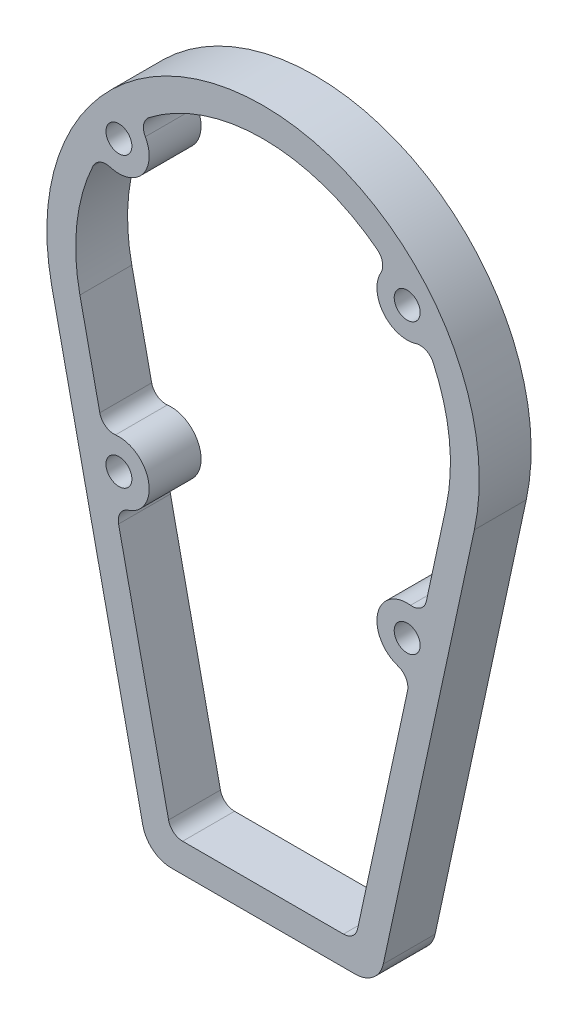
ISO-10303-21;
HEADER;
FILE_DESCRIPTION(('STEP AP214'),'2;1');
FILE_NAME('part.step','',(''),(''),'','','');
FILE_SCHEMA(('AUTOMOTIVE_DESIGN { 1 0 10303 214 1 1 1 1 }'));
ENDSEC;
DATA;
#1=APPLICATION_CONTEXT('core data for automotive mechanical design processes');
#2=APPLICATION_PROTOCOL_DEFINITION('international standard','automotive_design',2000,#1);
#3=PRODUCT_CONTEXT('',#1,'mechanical');
#4=PRODUCT('Part','Part','',(#3));
#5=PRODUCT_RELATED_PRODUCT_CATEGORY('part','',(#4));
#6=PRODUCT_DEFINITION_FORMATION('','',#4);
#7=PRODUCT_DEFINITION_CONTEXT('part definition',#1,'design');
#8=PRODUCT_DEFINITION('design','',#6,#7);
#9=PRODUCT_DEFINITION_SHAPE('','',#8);
#10=(LENGTH_UNIT() NAMED_UNIT(*) SI_UNIT(.MILLI.,.METRE.));
#11=(NAMED_UNIT(*) PLANE_ANGLE_UNIT() SI_UNIT($,.RADIAN.));
#12=(NAMED_UNIT(*) SI_UNIT($,.STERADIAN.) SOLID_ANGLE_UNIT());
#13=UNCERTAINTY_MEASURE_WITH_UNIT(LENGTH_MEASURE(1.E-05),#10,'distance_accuracy_value','');
#14=(GEOMETRIC_REPRESENTATION_CONTEXT(3) GLOBAL_UNCERTAINTY_ASSIGNED_CONTEXT((#13)) GLOBAL_UNIT_ASSIGNED_CONTEXT((#10,
#11,#12)) REPRESENTATION_CONTEXT('',''));
#15=CARTESIAN_POINT('',(0.,0.,0.));
#16=DIRECTION('',(0.,0.,1.));
#17=DIRECTION('',(1.,0.,0.));
#18=AXIS2_PLACEMENT_3D('',#15,#16,#17);
#19=CARTESIAN_POINT('',(-31.9298733487398,-112.5,18.));
#20=DIRECTION('',(0.,0.,1.));
#21=DIRECTION('',(1.,0.,0.));
#22=AXIS2_PLACEMENT_3D('',#19,#20,#21);
#23=PLANE('',#22);
#24=CARTESIAN_POINT('',(-50.,87.5,18.));
#25=DIRECTION('',(0.,0.,1.));
#26=DIRECTION('',(1.,0.,0.));
#27=AXIS2_PLACEMENT_3D('',#24,#25,#26);
#28=CIRCLE('',#27,4.5);
#29=CARTESIAN_POINT('',(-45.5,87.5,18.));
#30=VERTEX_POINT('',#29);
#31=EDGE_CURVE('E308',#30,#30,#28,.T.);
#32=ORIENTED_EDGE('',*,*,#31,.F.);
#33=EDGE_LOOP('',(#32));
#34=FACE_BOUND('',#33,.T.);
#35=CARTESIAN_POINT('',(50.,-12.5,18.));
#36=DIRECTION('',(0.,0.,1.));
#37=DIRECTION('',(1.,0.,0.));
#38=AXIS2_PLACEMENT_3D('',#35,#36,#37);
#39=CIRCLE('',#38,4.5);
#40=CARTESIAN_POINT('',(54.5,-12.5,18.));
#41=VERTEX_POINT('',#40);
#42=EDGE_CURVE('E320',#41,#41,#39,.T.);
#43=ORIENTED_EDGE('',*,*,#42,.F.);
#44=EDGE_LOOP('',(#43));
#45=FACE_BOUND('',#44,.T.);
#46=CARTESIAN_POINT('',(-31.9298733487398,-112.5,18.));
#47=DIRECTION('',(0.,0.,1.));
#48=DIRECTION('',(1.,0.,0.));
#49=AXIS2_PLACEMENT_3D('',#46,#47,#48);
#50=CIRCLE('',#49,10.);
#51=CARTESIAN_POINT('',(-41.7043249889033,-114.611893731726,18.));
#52=VERTEX_POINT('',#51);
#53=CARTESIAN_POINT('',(-31.9298733487398,-122.5,18.));
#54=VERTEX_POINT('',#53);
#55=EDGE_CURVE('E326',#52,#54,#50,.T.);
#56=ORIENTED_EDGE('',*,*,#55,.T.);
#57=DIRECTION('',(1.,0.,0.));
#58=VECTOR('',#57,1.);
#59=CARTESIAN_POINT('',(-31.9298733487398,-122.5,18.));
#60=LINE('',#59,#58);
#61=CARTESIAN_POINT('',(31.9298733487398,-122.5,18.));
#62=VERTEX_POINT('',#61);
#63=EDGE_CURVE('E329',#54,#62,#60,.T.);
#64=ORIENTED_EDGE('',*,*,#63,.T.);
#65=CARTESIAN_POINT('',(31.9298733487398,-112.5,18.));
#66=DIRECTION('',(0.,0.,1.));
#67=DIRECTION('',(1.,0.,0.));
#68=AXIS2_PLACEMENT_3D('',#65,#66,#67);
#69=CIRCLE('',#68,10.);
#70=CARTESIAN_POINT('',(41.7043249889033,-114.611893731726,18.));
#71=VERTEX_POINT('',#70);
#72=EDGE_CURVE('E332',#62,#71,#69,.T.);
#73=ORIENTED_EDGE('',*,*,#72,.T.);
#74=DIRECTION('',(0.211189373172623,0.977445164016353,0.));
#75=VECTOR('',#74,1.);
#76=CARTESIAN_POINT('',(41.7043249889033,-114.611893731726,18.));
#77=LINE('',#76,#75);
#78=CARTESIAN_POINT('',(73.3083873012265,31.6607970120533,18.));
#79=VERTEX_POINT('',#78);
#80=EDGE_CURVE('E334',#71,#79,#77,.T.);
#81=ORIENTED_EDGE('',*,*,#80,.T.);
#82=CARTESIAN_POINT('',(0.,47.5,18.));
#83=DIRECTION('',(0.,0.,1.));
#84=DIRECTION('',(1.,0.,0.));
#85=AXIS2_PLACEMENT_3D('',#82,#83,#84);
#86=CIRCLE('',#85,75.);
#87=CARTESIAN_POINT('',(-73.3083873012264,31.6607970120533,18.));
#88=VERTEX_POINT('',#87);
#89=EDGE_CURVE('E336',#79,#88,#86,.T.);
#90=ORIENTED_EDGE('',*,*,#89,.T.);
#91=DIRECTION('',(0.211189373172623,-0.977445164016353,0.));
#92=VECTOR('',#91,1.);
#93=CARTESIAN_POINT('',(-73.3083873012264,31.6607970120533,18.));
#94=LINE('',#93,#92);
#95=EDGE_CURVE('E338',#88,#52,#94,.T.);
#96=ORIENTED_EDGE('',*,*,#95,.T.);
#97=EDGE_LOOP('',(#56,#64,#73,#81,#90,#96));
#98=FACE_BOUND('',#97,.T.);
#99=CARTESIAN_POINT('',(50.,87.5,18.));
#100=DIRECTION('',(0.,0.,1.));
#101=DIRECTION('',(1.,0.,0.));
#102=AXIS2_PLACEMENT_3D('',#99,#100,#101);
#103=CIRCLE('',#102,4.5);
#104=CARTESIAN_POINT('',(54.5,87.5,18.));
#105=VERTEX_POINT('',#104);
#106=EDGE_CURVE('E314',#105,#105,#103,.T.);
#107=ORIENTED_EDGE('',*,*,#106,.F.);
#108=EDGE_LOOP('',(#107));
#109=FACE_BOUND('',#108,.T.);
#110=CARTESIAN_POINT('',(-50.,-12.5,18.));
#111=DIRECTION('',(0.,0.,1.));
#112=DIRECTION('',(1.,0.,0.));
#113=AXIS2_PLACEMENT_3D('',#110,#111,#112);
#114=CIRCLE('',#113,4.5);
#115=CARTESIAN_POINT('',(-45.5,-12.5,18.));
#116=VERTEX_POINT('',#115);
#117=EDGE_CURVE('E302',#116,#116,#114,.T.);
#118=ORIENTED_EDGE('',*,*,#117,.F.);
#119=EDGE_LOOP('',(#118));
#120=FACE_BOUND('',#119,.T.);
#121=DIRECTION('',(0.211189373172623,0.977445164016353,0.));
#122=VECTOR('',#121,1.);
#123=CARTESIAN_POINT('',(55.4723236772757,-3.53876830055554,18.));
#124=LINE('',#123,#122);
#125=CARTESIAN_POINT('',(56.63558344571,1.84513249932773,18.));
#126=VERTEX_POINT('',#125);
#127=CARTESIAN_POINT('',(63.5339356610629,33.7726907437795,18.));
#128=VERTEX_POINT('',#127);
#129=EDGE_CURVE('E215',#126,#128,#124,.T.);
#130=ORIENTED_EDGE('',*,*,#129,.F.);
#131=CARTESIAN_POINT('',(51.7483576256282,2.90107936519085,18.));
#132=DIRECTION('',(0.,0.,1.));
#133=DIRECTION('',(1.,0.,0.));
#134=AXIS2_PLACEMENT_3D('',#131,#132,#133);
#135=CIRCLE('',#134,5.);
#136=CARTESIAN_POINT('',(51.1843712947804,-2.06701075261265,18.));
#137=VERTEX_POINT('',#136);
#138=EDGE_CURVE('E431',#126,#137,#135,.F.);
#139=ORIENTED_EDGE('',*,*,#138,.T.);
#140=CARTESIAN_POINT('',(50.,-12.5,18.));
#141=DIRECTION('',(0.,0.,-1.));
#142=DIRECTION('',(1.,0.,0.));
#143=AXIS2_PLACEMENT_3D('',#140,#141,#142);
#144=CIRCLE('',#143,10.5);
#145=CARTESIAN_POINT('',(46.7714419877795,-22.4913168882648,18.));
#146=VERTEX_POINT('',#145);
#147=EDGE_CURVE('E227',#146,#137,#144,.T.);
#148=ORIENTED_EDGE('',*,*,#147,.F.);
#149=CARTESIAN_POINT('',(45.2340334105316,-27.2490868350576,18.));
#150=DIRECTION('',(0.,0.,1.));
#151=DIRECTION('',(1.,0.,0.));
#152=AXIS2_PLACEMENT_3D('',#149,#150,#151);
#153=CIRCLE('',#152,5.);
#154=CARTESIAN_POINT('',(50.1212592306133,-28.3050337009207,18.));
#155=VERTEX_POINT('',#154);
#156=EDGE_CURVE('E435',#146,#155,#153,.F.);
#157=ORIENTED_EDGE('',*,*,#156,.T.);
#158=DIRECTION('',(0.211189373172623,0.977445164016353,0.));
#159=VECTOR('',#158,1.);
#160=CARTESIAN_POINT('',(31.9298733487398,-112.5,18.));
#161=LINE('',#160,#159);
#162=CARTESIAN_POINT('',(32.7820358431914,-108.555946865863,18.));
#163=VERTEX_POINT('',#162);
#164=EDGE_CURVE('E267',#163,#155,#161,.T.);
#165=ORIENTED_EDGE('',*,*,#164,.F.);
#166=CARTESIAN_POINT('',(27.8948100231097,-107.5,18.));
#167=DIRECTION('',(0.,0.,1.));
#168=DIRECTION('',(1.,0.,0.));
#169=AXIS2_PLACEMENT_3D('',#166,#167,#168);
#170=CIRCLE('',#169,5.);
#171=CARTESIAN_POINT('',(27.8948100231097,-112.5,18.));
#172=VERTEX_POINT('',#171);
#173=EDGE_CURVE('E381',#163,#172,#170,.F.);
#174=ORIENTED_EDGE('',*,*,#173,.T.);
#175=DIRECTION('',(1.,0.,0.));
#176=VECTOR('',#175,1.);
#177=CARTESIAN_POINT('',(-31.9298733487398,-112.5,18.));
#178=LINE('',#177,#176);
#179=CARTESIAN_POINT('',(-27.8948100231097,-112.5,18.));
#180=VERTEX_POINT('',#179);
#181=EDGE_CURVE('E264',#180,#172,#178,.T.);
#182=ORIENTED_EDGE('',*,*,#181,.F.);
#183=CARTESIAN_POINT('',(-27.8948100231097,-107.5,18.));
#184=DIRECTION('',(0.,0.,1.));
#185=DIRECTION('',(1.,0.,0.));
#186=AXIS2_PLACEMENT_3D('',#183,#184,#185);
#187=CIRCLE('',#186,5.);
#188=CARTESIAN_POINT('',(-32.7820358431915,-108.555946865863,18.));
#189=VERTEX_POINT('',#188);
#190=EDGE_CURVE('E385',#180,#189,#187,.F.);
#191=ORIENTED_EDGE('',*,*,#190,.T.);
#192=DIRECTION('',(0.211189373172623,-0.977445164016353,0.));
#193=VECTOR('',#192,1.);
#194=CARTESIAN_POINT('',(-31.9298733487398,-112.5,18.));
#195=LINE('',#194,#193);
#196=CARTESIAN_POINT('',(-50.1212592306133,-28.3050337009208,18.));
#197=VERTEX_POINT('',#196);
#198=EDGE_CURVE('E262',#197,#189,#195,.T.);
#199=ORIENTED_EDGE('',*,*,#198,.F.);
#200=CARTESIAN_POINT('',(-45.2340334105316,-27.2490868350576,18.));
#201=DIRECTION('',(0.,0.,1.));
#202=DIRECTION('',(1.,0.,0.));
#203=AXIS2_PLACEMENT_3D('',#200,#201,#202);
#204=CIRCLE('',#203,5.);
#205=CARTESIAN_POINT('',(-46.7714419877795,-22.4913168882649,18.));
#206=VERTEX_POINT('',#205);
#207=EDGE_CURVE('E439',#197,#206,#204,.F.);
#208=ORIENTED_EDGE('',*,*,#207,.T.);
#209=CARTESIAN_POINT('',(-50.,-12.5,18.));
#210=DIRECTION('',(0.,0.,-1.));
#211=DIRECTION('',(1.,0.,0.));
#212=AXIS2_PLACEMENT_3D('',#209,#210,#211);
#213=CIRCLE('',#212,10.5);
#214=CARTESIAN_POINT('',(-51.1843712947804,-2.06701075261266,18.));
#215=VERTEX_POINT('',#214);
#216=EDGE_CURVE('E259',#215,#206,#213,.T.);
#217=ORIENTED_EDGE('',*,*,#216,.F.);
#218=CARTESIAN_POINT('',(-51.7483576256283,2.90107936519085,18.));
#219=DIRECTION('',(0.,0.,1.));
#220=DIRECTION('',(1.,0.,0.));
#221=AXIS2_PLACEMENT_3D('',#218,#219,#220);
#222=CIRCLE('',#221,5.);
#223=CARTESIAN_POINT('',(-56.63558344571,1.84513249932773,18.));
#224=VERTEX_POINT('',#223);
#225=EDGE_CURVE('E427',#215,#224,#222,.F.);
#226=ORIENTED_EDGE('',*,*,#225,.T.);
#227=DIRECTION('',(0.211189373172623,-0.977445164016353,0.));
#228=VECTOR('',#227,1.);
#229=CARTESIAN_POINT('',(-55.4723236772757,-3.53876830055558,18.));
#230=LINE('',#229,#228);
#231=CARTESIAN_POINT('',(-63.5339356610629,33.7726907437795,18.));
#232=VERTEX_POINT('',#231);
#233=EDGE_CURVE('E256',#232,#224,#230,.T.);
#234=ORIENTED_EDGE('',*,*,#233,.F.);
#235=CARTESIAN_POINT('',(0.,47.5,18.));
#236=DIRECTION('',(0.,0.,1.));
#237=DIRECTION('',(1.,0.,0.));
#238=AXIS2_PLACEMENT_3D('',#235,#236,#237);
#239=CIRCLE('',#238,65.);
#240=CARTESIAN_POINT('',(-59.0097536999229,74.755255791763,18.));
#241=VERTEX_POINT('',#240);
#242=EDGE_CURVE('E254',#241,#232,#239,.T.);
#243=ORIENTED_EDGE('',*,*,#242,.F.);
#244=CARTESIAN_POINT('',(-54.4705418768519,72.6586976539351,18.));
#245=DIRECTION('',(0.,0.,1.));
#246=DIRECTION('',(1.,0.,0.));
#247=AXIS2_PLACEMENT_3D('',#244,#245,#246);
#248=CIRCLE('',#247,5.);
#249=CARTESIAN_POINT('',(-53.0284315939965,77.4462145397625,18.));
#250=VERTEX_POINT('',#249);
#251=EDGE_CURVE('E11',#241,#250,#248,.F.);
#252=ORIENTED_EDGE('',*,*,#251,.T.);
#253=CARTESIAN_POINT('',(-50.,87.5,18.));
#254=DIRECTION('',(0.,0.,-1.));
#255=DIRECTION('',(1.,0.,0.));
#256=AXIS2_PLACEMENT_3D('',#253,#254,#255);
#257=CIRCLE('',#256,10.5);
#258=CARTESIAN_POINT('',(-40.8562064862553,92.661495924439,18.));
#259=VERTEX_POINT('',#258);
#260=EDGE_CURVE('E251',#259,#250,#257,.T.);
#261=ORIENTED_EDGE('',*,*,#260,.F.);
#262=CARTESIAN_POINT('',(-36.5020190987578,95.1193511265528,18.));
#263=DIRECTION('',(0.,0.,1.));
#264=DIRECTION('',(1.,0.,0.));
#265=AXIS2_PLACEMENT_3D('',#262,#263,#264);
#266=CIRCLE('',#265,5.);
#267=CARTESIAN_POINT('',(-39.5438540236543,99.0876303870988,18.));
#268=VERTEX_POINT('',#267);
#269=EDGE_CURVE('E450',#259,#268,#266,.F.);
#270=ORIENTED_EDGE('',*,*,#269,.T.);
#271=CARTESIAN_POINT('',(0.,47.5,18.));
#272=DIRECTION('',(0.,0.,1.));
#273=DIRECTION('',(1.,0.,0.));
#274=AXIS2_PLACEMENT_3D('',#271,#272,#273);
#275=CIRCLE('',#274,65.);
#276=CARTESIAN_POINT('',(39.5438540236543,99.0876303870988,18.));
#277=VERTEX_POINT('',#276);
#278=EDGE_CURVE('E245',#277,#268,#275,.T.);
#279=ORIENTED_EDGE('',*,*,#278,.F.);
#280=CARTESIAN_POINT('',(36.5020190987578,95.1193511265527,18.));
#281=DIRECTION('',(0.,0.,1.));
#282=DIRECTION('',(1.,0.,0.));
#283=AXIS2_PLACEMENT_3D('',#280,#281,#282);
#284=CIRCLE('',#283,5.);
#285=CARTESIAN_POINT('',(40.8562064862553,92.6614959244389,18.));
#286=VERTEX_POINT('',#285);
#287=EDGE_CURVE('E446',#277,#286,#284,.F.);
#288=ORIENTED_EDGE('',*,*,#287,.T.);
#289=CARTESIAN_POINT('',(50.,87.5,18.));
#290=DIRECTION('',(0.,0.,-1.));
#291=DIRECTION('',(1.,0.,0.));
#292=AXIS2_PLACEMENT_3D('',#289,#290,#291);
#293=CIRCLE('',#292,10.5);
#294=CARTESIAN_POINT('',(53.0284315939965,77.4462145397625,18.));
#295=VERTEX_POINT('',#294);
#296=EDGE_CURVE('E242',#295,#286,#293,.T.);
#297=ORIENTED_EDGE('',*,*,#296,.F.);
#298=CARTESIAN_POINT('',(54.470541876852,72.6586976539351,18.));
#299=DIRECTION('',(0.,0.,1.));
#300=DIRECTION('',(1.,0.,0.));
#301=AXIS2_PLACEMENT_3D('',#298,#299,#300);
#302=CIRCLE('',#301,5.);
#303=CARTESIAN_POINT('',(59.009753699923,74.755255791763,18.));
#304=VERTEX_POINT('',#303);
#305=EDGE_CURVE('E241',#295,#304,#302,.F.);
#306=ORIENTED_EDGE('',*,*,#305,.T.);
#307=CARTESIAN_POINT('',(0.,47.5,18.));
#308=DIRECTION('',(0.,0.,1.));
#309=DIRECTION('',(1.,0.,0.));
#310=AXIS2_PLACEMENT_3D('',#307,#308,#309);
#311=CIRCLE('',#310,65.);
#312=EDGE_CURVE('E226',#128,#304,#311,.T.);
#313=ORIENTED_EDGE('',*,*,#312,.F.);
#314=EDGE_LOOP('',(#130,#139,#148,#157,#165,#174,#182,#191,#199,#208,#217,#226,#234,#243,#252,
#261,#270,#279,#288,#297,#306,#313));
#315=FACE_BOUND('',#314,.T.);
#316=ADVANCED_FACE('F32',(#34,#45,#98,#109,#120,#315),#23,.T.);
#317=CARTESIAN_POINT('',(-31.9298733487398,-112.5,0.));
#318=DIRECTION('',(0.,0.,1.));
#319=DIRECTION('',(1.,0.,0.));
#320=AXIS2_PLACEMENT_3D('',#317,#318,#319);
#321=PLANE('',#320);
#322=CARTESIAN_POINT('',(-50.,-12.5,0.));
#323=DIRECTION('',(0.,0.,1.));
#324=DIRECTION('',(1.,0.,0.));
#325=AXIS2_PLACEMENT_3D('',#322,#323,#324);
#326=CIRCLE('',#325,4.5);
#327=CARTESIAN_POINT('',(-45.5,-12.5,0.));
#328=VERTEX_POINT('',#327);
#329=EDGE_CURVE('E236',#328,#328,#326,.T.);
#330=ORIENTED_EDGE('',*,*,#329,.T.);
#331=EDGE_LOOP('',(#330));
#332=FACE_BOUND('',#331,.T.);
#333=CARTESIAN_POINT('',(-50.,87.5,0.));
#334=DIRECTION('',(0.,0.,1.));
#335=DIRECTION('',(1.,0.,0.));
#336=AXIS2_PLACEMENT_3D('',#333,#334,#335);
#337=CIRCLE('',#336,4.5);
#338=CARTESIAN_POINT('',(-45.5,87.5,0.));
#339=VERTEX_POINT('',#338);
#340=EDGE_CURVE('E305',#339,#339,#337,.T.);
#341=ORIENTED_EDGE('',*,*,#340,.T.);
#342=EDGE_LOOP('',(#341));
#343=FACE_BOUND('',#342,.T.);
#344=CARTESIAN_POINT('',(50.,87.5,0.));
#345=DIRECTION('',(0.,0.,1.));
#346=DIRECTION('',(1.,0.,0.));
#347=AXIS2_PLACEMENT_3D('',#344,#345,#346);
#348=CIRCLE('',#347,4.5);
#349=CARTESIAN_POINT('',(54.5,87.5,0.));
#350=VERTEX_POINT('',#349);
#351=EDGE_CURVE('E311',#350,#350,#348,.T.);
#352=ORIENTED_EDGE('',*,*,#351,.T.);
#353=EDGE_LOOP('',(#352));
#354=FACE_BOUND('',#353,.T.);
#355=CARTESIAN_POINT('',(50.,-12.5,0.));
#356=DIRECTION('',(0.,0.,1.));
#357=DIRECTION('',(1.,0.,0.));
#358=AXIS2_PLACEMENT_3D('',#355,#356,#357);
#359=CIRCLE('',#358,4.5);
#360=CARTESIAN_POINT('',(54.5,-12.5,0.));
#361=VERTEX_POINT('',#360);
#362=EDGE_CURVE('E317',#361,#361,#359,.T.);
#363=ORIENTED_EDGE('',*,*,#362,.T.);
#364=EDGE_LOOP('',(#363));
#365=FACE_BOUND('',#364,.T.);
#366=CARTESIAN_POINT('',(-31.9298733487398,-112.5,0.));
#367=DIRECTION('',(0.,0.,1.));
#368=DIRECTION('',(1.,0.,0.));
#369=AXIS2_PLACEMENT_3D('',#366,#367,#368);
#370=CIRCLE('',#369,10.);
#371=CARTESIAN_POINT('',(-41.7043249889033,-114.611893731726,0.));
#372=VERTEX_POINT('',#371);
#373=CARTESIAN_POINT('',(-31.9298733487398,-122.5,0.));
#374=VERTEX_POINT('',#373);
#375=EDGE_CURVE('E323',#372,#374,#370,.T.);
#376=ORIENTED_EDGE('',*,*,#375,.F.);
#377=DIRECTION('',(0.211189373172623,-0.977445164016353,0.));
#378=VECTOR('',#377,1.);
#379=CARTESIAN_POINT('',(-73.3083873012264,31.6607970120533,0.));
#380=LINE('',#379,#378);
#381=CARTESIAN_POINT('',(-73.3083873012264,31.6607970120533,0.));
#382=VERTEX_POINT('',#381);
#383=EDGE_CURVE('E330',#382,#372,#380,.T.);
#384=ORIENTED_EDGE('',*,*,#383,.F.);
#385=CARTESIAN_POINT('',(0.,47.5,0.));
#386=DIRECTION('',(0.,0.,1.));
#387=DIRECTION('',(1.,0.,0.));
#388=AXIS2_PLACEMENT_3D('',#385,#386,#387);
#389=CIRCLE('',#388,75.);
#390=CARTESIAN_POINT('',(73.3083873012265,31.6607970120533,0.));
#391=VERTEX_POINT('',#390);
#392=EDGE_CURVE('E349',#391,#382,#389,.T.);
#393=ORIENTED_EDGE('',*,*,#392,.F.);
#394=DIRECTION('',(0.211189373172623,0.977445164016353,0.));
#395=VECTOR('',#394,1.);
#396=CARTESIAN_POINT('',(41.7043249889033,-114.611893731726,0.));
#397=LINE('',#396,#395);
#398=CARTESIAN_POINT('',(41.7043249889033,-114.611893731726,0.));
#399=VERTEX_POINT('',#398);
#400=EDGE_CURVE('E347',#399,#391,#397,.T.);
#401=ORIENTED_EDGE('',*,*,#400,.F.);
#402=CARTESIAN_POINT('',(31.9298733487398,-112.5,0.));
#403=DIRECTION('',(0.,0.,1.));
#404=DIRECTION('',(1.,0.,0.));
#405=AXIS2_PLACEMENT_3D('',#402,#403,#404);
#406=CIRCLE('',#405,10.);
#407=CARTESIAN_POINT('',(31.9298733487398,-122.5,0.));
#408=VERTEX_POINT('',#407);
#409=EDGE_CURVE('E345',#408,#399,#406,.T.);
#410=ORIENTED_EDGE('',*,*,#409,.F.);
#411=DIRECTION('',(1.,0.,0.));
#412=VECTOR('',#411,1.);
#413=CARTESIAN_POINT('',(-31.9298733487398,-122.5,0.));
#414=LINE('',#413,#412);
#415=EDGE_CURVE('E343',#374,#408,#414,.T.);
#416=ORIENTED_EDGE('',*,*,#415,.F.);
#417=EDGE_LOOP('',(#376,#384,#393,#401,#410,#416));
#418=FACE_BOUND('',#417,.T.);
#419=DIRECTION('',(0.211189373172623,0.977445164016353,0.));
#420=VECTOR('',#419,1.);
#421=CARTESIAN_POINT('',(31.9298733487398,-112.5,0.));
#422=LINE('',#421,#420);
#423=CARTESIAN_POINT('',(32.7820358431914,-108.555946865863,0.));
#424=VERTEX_POINT('',#423);
#425=CARTESIAN_POINT('',(50.1212592306133,-28.3050337009207,0.));
#426=VERTEX_POINT('',#425);
#427=EDGE_CURVE('E297',#424,#426,#422,.T.);
#428=ORIENTED_EDGE('',*,*,#427,.T.);
#429=CARTESIAN_POINT('',(45.2340334105316,-27.2490868350576,0.));
#430=DIRECTION('',(0.,0.,1.));
#431=DIRECTION('',(1.,0.,0.));
#432=AXIS2_PLACEMENT_3D('',#429,#430,#431);
#433=CIRCLE('',#432,5.);
#434=CARTESIAN_POINT('',(46.7714419877795,-22.4913168882648,0.));
#435=VERTEX_POINT('',#434);
#436=EDGE_CURVE('E433',#426,#435,#433,.T.);
#437=ORIENTED_EDGE('',*,*,#436,.T.);
#438=CARTESIAN_POINT('',(50.,-12.5,0.));
#439=DIRECTION('',(0.,0.,-1.));
#440=DIRECTION('',(1.,0.,0.));
#441=AXIS2_PLACEMENT_3D('',#438,#439,#440);
#442=CIRCLE('',#441,10.5);
#443=CARTESIAN_POINT('',(51.1843712947804,-2.06701075261265,0.));
#444=VERTEX_POINT('',#443);
#445=EDGE_CURVE('E270',#435,#444,#442,.T.);
#446=ORIENTED_EDGE('',*,*,#445,.T.);
#447=CARTESIAN_POINT('',(51.7483576256282,2.90107936519085,0.));
#448=DIRECTION('',(0.,0.,1.));
#449=DIRECTION('',(1.,0.,0.));
#450=AXIS2_PLACEMENT_3D('',#447,#448,#449);
#451=CIRCLE('',#450,5.);
#452=CARTESIAN_POINT('',(56.63558344571,1.84513249932773,0.));
#453=VERTEX_POINT('',#452);
#454=EDGE_CURVE('E429',#444,#453,#451,.T.);
#455=ORIENTED_EDGE('',*,*,#454,.T.);
#456=DIRECTION('',(0.211189373172623,0.977445164016353,0.));
#457=VECTOR('',#456,1.);
#458=CARTESIAN_POINT('',(55.4723236772757,-3.53876830055554,0.));
#459=LINE('',#458,#457);
#460=CARTESIAN_POINT('',(63.5339356610629,33.7726907437795,0.));
#461=VERTEX_POINT('',#460);
#462=EDGE_CURVE('E273',#453,#461,#459,.T.);
#463=ORIENTED_EDGE('',*,*,#462,.T.);
#464=CARTESIAN_POINT('',(0.,47.5,0.));
#465=DIRECTION('',(0.,0.,1.));
#466=DIRECTION('',(1.,0.,0.));
#467=AXIS2_PLACEMENT_3D('',#464,#465,#466);
#468=CIRCLE('',#467,65.);
#469=CARTESIAN_POINT('',(59.009753699923,74.755255791763,0.));
#470=VERTEX_POINT('',#469);
#471=EDGE_CURVE('E235',#461,#470,#468,.T.);
#472=ORIENTED_EDGE('',*,*,#471,.T.);
#473=CARTESIAN_POINT('',(54.470541876852,72.6586976539351,0.));
#474=DIRECTION('',(0.,0.,1.));
#475=DIRECTION('',(1.,0.,0.));
#476=AXIS2_PLACEMENT_3D('',#473,#474,#475);
#477=CIRCLE('',#476,5.);
#478=CARTESIAN_POINT('',(53.0284315939965,77.4462145397625,0.));
#479=VERTEX_POINT('',#478);
#480=EDGE_CURVE('E441',#470,#479,#477,.T.);
#481=ORIENTED_EDGE('',*,*,#480,.T.);
#482=CARTESIAN_POINT('',(50.,87.5,0.));
#483=DIRECTION('',(0.,0.,-1.));
#484=DIRECTION('',(1.,0.,0.));
#485=AXIS2_PLACEMENT_3D('',#482,#483,#484);
#486=CIRCLE('',#485,10.5);
#487=CARTESIAN_POINT('',(40.8562064862553,92.6614959244389,0.));
#488=VERTEX_POINT('',#487);
#489=EDGE_CURVE('E276',#479,#488,#486,.T.);
#490=ORIENTED_EDGE('',*,*,#489,.T.);
#491=CARTESIAN_POINT('',(36.5020190987578,95.1193511265527,0.));
#492=DIRECTION('',(0.,0.,1.));
#493=DIRECTION('',(1.,0.,0.));
#494=AXIS2_PLACEMENT_3D('',#491,#492,#493);
#495=CIRCLE('',#494,5.);
#496=CARTESIAN_POINT('',(39.5438540236543,99.0876303870988,0.));
#497=VERTEX_POINT('',#496);
#498=EDGE_CURVE('E444',#488,#497,#495,.T.);
#499=ORIENTED_EDGE('',*,*,#498,.T.);
#500=CARTESIAN_POINT('',(0.,47.5,0.));
#501=DIRECTION('',(0.,0.,1.));
#502=DIRECTION('',(1.,0.,0.));
#503=AXIS2_PLACEMENT_3D('',#500,#501,#502);
#504=CIRCLE('',#503,65.);
#505=CARTESIAN_POINT('',(-39.5438540236543,99.0876303870988,0.));
#506=VERTEX_POINT('',#505);
#507=EDGE_CURVE('E279',#497,#506,#504,.T.);
#508=ORIENTED_EDGE('',*,*,#507,.T.);
#509=CARTESIAN_POINT('',(-36.5020190987578,95.1193511265528,0.));
#510=DIRECTION('',(0.,0.,1.));
#511=DIRECTION('',(1.,0.,0.));
#512=AXIS2_PLACEMENT_3D('',#509,#510,#511);
#513=CIRCLE('',#512,5.);
#514=CARTESIAN_POINT('',(-40.8562064862553,92.661495924439,0.));
#515=VERTEX_POINT('',#514);
#516=EDGE_CURVE('E448',#506,#515,#513,.T.);
#517=ORIENTED_EDGE('',*,*,#516,.T.);
#518=CARTESIAN_POINT('',(-50.,87.5,0.));
#519=DIRECTION('',(0.,0.,-1.));
#520=DIRECTION('',(1.,0.,0.));
#521=AXIS2_PLACEMENT_3D('',#518,#519,#520);
#522=CIRCLE('',#521,10.5);
#523=CARTESIAN_POINT('',(-53.0284315939965,77.4462145397625,0.));
#524=VERTEX_POINT('',#523);
#525=EDGE_CURVE('E282',#515,#524,#522,.T.);
#526=ORIENTED_EDGE('',*,*,#525,.T.);
#527=CARTESIAN_POINT('',(-54.4705418768519,72.6586976539351,0.));
#528=DIRECTION('',(0.,0.,1.));
#529=DIRECTION('',(1.,0.,0.));
#530=AXIS2_PLACEMENT_3D('',#527,#528,#529);
#531=CIRCLE('',#530,5.);
#532=CARTESIAN_POINT('',(-59.0097536999229,74.755255791763,0.));
#533=VERTEX_POINT('',#532);
#534=EDGE_CURVE('E40',#524,#533,#531,.T.);
#535=ORIENTED_EDGE('',*,*,#534,.T.);
#536=CARTESIAN_POINT('',(0.,47.5,0.));
#537=DIRECTION('',(0.,0.,1.));
#538=DIRECTION('',(1.,0.,0.));
#539=AXIS2_PLACEMENT_3D('',#536,#537,#538);
#540=CIRCLE('',#539,65.);
#541=CARTESIAN_POINT('',(-63.5339356610629,33.7726907437795,0.));
#542=VERTEX_POINT('',#541);
#543=EDGE_CURVE('E284',#533,#542,#540,.T.);
#544=ORIENTED_EDGE('',*,*,#543,.T.);
#545=DIRECTION('',(0.211189373172623,-0.977445164016353,0.));
#546=VECTOR('',#545,1.);
#547=CARTESIAN_POINT('',(-55.4723236772757,-3.53876830055558,0.));
#548=LINE('',#547,#546);
#549=CARTESIAN_POINT('',(-56.63558344571,1.84513249932773,0.));
#550=VERTEX_POINT('',#549);
#551=EDGE_CURVE('E286',#542,#550,#548,.T.);
#552=ORIENTED_EDGE('',*,*,#551,.T.);
#553=CARTESIAN_POINT('',(-51.7483576256283,2.90107936519085,0.));
#554=DIRECTION('',(0.,0.,1.));
#555=DIRECTION('',(1.,0.,0.));
#556=AXIS2_PLACEMENT_3D('',#553,#554,#555);
#557=CIRCLE('',#556,5.);
#558=CARTESIAN_POINT('',(-51.1843712947804,-2.06701075261266,0.));
#559=VERTEX_POINT('',#558);
#560=EDGE_CURVE('E425',#550,#559,#557,.T.);
#561=ORIENTED_EDGE('',*,*,#560,.T.);
#562=CARTESIAN_POINT('',(-50.,-12.5,0.));
#563=DIRECTION('',(0.,0.,-1.));
#564=DIRECTION('',(1.,0.,0.));
#565=AXIS2_PLACEMENT_3D('',#562,#563,#564);
#566=CIRCLE('',#565,10.5);
#567=CARTESIAN_POINT('',(-46.7714419877795,-22.4913168882649,0.));
#568=VERTEX_POINT('',#567);
#569=EDGE_CURVE('E289',#559,#568,#566,.T.);
#570=ORIENTED_EDGE('',*,*,#569,.T.);
#571=CARTESIAN_POINT('',(-45.2340334105316,-27.2490868350576,0.));
#572=DIRECTION('',(0.,0.,1.));
#573=DIRECTION('',(1.,0.,0.));
#574=AXIS2_PLACEMENT_3D('',#571,#572,#573);
#575=CIRCLE('',#574,5.);
#576=CARTESIAN_POINT('',(-50.1212592306133,-28.3050337009208,0.));
#577=VERTEX_POINT('',#576);
#578=EDGE_CURVE('E437',#568,#577,#575,.T.);
#579=ORIENTED_EDGE('',*,*,#578,.T.);
#580=DIRECTION('',(0.211189373172623,-0.977445164016353,0.));
#581=VECTOR('',#580,1.);
#582=CARTESIAN_POINT('',(-31.9298733487398,-112.5,0.));
#583=LINE('',#582,#581);
#584=CARTESIAN_POINT('',(-32.7820358431915,-108.555946865863,0.));
#585=VERTEX_POINT('',#584);
#586=EDGE_CURVE('E292',#577,#585,#583,.T.);
#587=ORIENTED_EDGE('',*,*,#586,.T.);
#588=CARTESIAN_POINT('',(-27.8948100231097,-107.5,0.));
#589=DIRECTION('',(0.,0.,1.));
#590=DIRECTION('',(1.,0.,0.));
#591=AXIS2_PLACEMENT_3D('',#588,#589,#590);
#592=CIRCLE('',#591,5.);
#593=CARTESIAN_POINT('',(-27.8948100231097,-112.5,0.));
#594=VERTEX_POINT('',#593);
#595=EDGE_CURVE('E383',#585,#594,#592,.T.);
#596=ORIENTED_EDGE('',*,*,#595,.T.);
#597=DIRECTION('',(1.,0.,0.));
#598=VECTOR('',#597,1.);
#599=CARTESIAN_POINT('',(-31.9298733487398,-112.5,0.));
#600=LINE('',#599,#598);
#601=CARTESIAN_POINT('',(27.8948100231097,-112.5,0.));
#602=VERTEX_POINT('',#601);
#603=EDGE_CURVE('E294',#594,#602,#600,.T.);
#604=ORIENTED_EDGE('',*,*,#603,.T.);
#605=CARTESIAN_POINT('',(27.8948100231097,-107.5,0.));
#606=DIRECTION('',(0.,0.,1.));
#607=DIRECTION('',(1.,0.,0.));
#608=AXIS2_PLACEMENT_3D('',#605,#606,#607);
#609=CIRCLE('',#608,5.);
#610=EDGE_CURVE('E379',#602,#424,#609,.T.);
#611=ORIENTED_EDGE('',*,*,#610,.T.);
#612=EDGE_LOOP('',(#428,#437,#446,#455,#463,#472,#481,#490,#499,#508,#517,#526,#535,#544,#552,
#561,#570,#579,#587,#596,#604,#611));
#613=FACE_BOUND('',#612,.T.);
#614=ADVANCED_FACE('F464',(#332,#343,#354,#365,#418,#613),#321,.F.);
#615=CARTESIAN_POINT('',(-31.9298733487398,-112.5,18.));
#616=DIRECTION('',(0.,0.,-1.));
#617=DIRECTION('',(-1.,0.,0.));
#618=AXIS2_PLACEMENT_3D('',#615,#616,#617);
#619=CYLINDRICAL_SURFACE('',#618,10.);
#620=ORIENTED_EDGE('',*,*,#375,.T.);
#621=DIRECTION('',(0.,0.,-1.));
#622=VECTOR('',#621,1.);
#623=CARTESIAN_POINT('',(-31.9298733487398,-122.5,18.));
#624=LINE('',#623,#622);
#625=EDGE_CURVE('E366',#54,#374,#624,.T.);
#626=ORIENTED_EDGE('',*,*,#625,.F.);
#627=ORIENTED_EDGE('',*,*,#55,.F.);
#628=DIRECTION('',(0.,0.,-1.));
#629=VECTOR('',#628,1.);
#630=CARTESIAN_POINT('',(-41.7043249889033,-114.611893731726,18.));
#631=LINE('',#630,#629);
#632=EDGE_CURVE('E340',#52,#372,#631,.T.);
#633=ORIENTED_EDGE('',*,*,#632,.T.);
#634=EDGE_LOOP('',(#620,#626,#627,#633));
#635=FACE_BOUND('',#634,.T.);
#636=ADVANCED_FACE('F549',(#635),#619,.T.);
#637=CARTESIAN_POINT('',(-31.9298733487398,-122.5,18.));
#638=DIRECTION('',(0.,1.,0.));
#639=DIRECTION('',(0.,0.,1.));
#640=AXIS2_PLACEMENT_3D('',#637,#638,#639);
#641=PLANE('',#640);
#642=ORIENTED_EDGE('',*,*,#415,.T.);
#643=DIRECTION('',(0.,0.,-1.));
#644=VECTOR('',#643,1.);
#645=CARTESIAN_POINT('',(31.9298733487398,-122.5,18.));
#646=LINE('',#645,#644);
#647=EDGE_CURVE('E363',#62,#408,#646,.T.);
#648=ORIENTED_EDGE('',*,*,#647,.F.);
#649=ORIENTED_EDGE('',*,*,#63,.F.);
#650=ORIENTED_EDGE('',*,*,#625,.T.);
#651=EDGE_LOOP('',(#642,#648,#649,#650));
#652=FACE_BOUND('',#651,.T.);
#653=ADVANCED_FACE('F573',(#652),#641,.F.);
#654=CARTESIAN_POINT('',(31.9298733487398,-112.5,18.));
#655=DIRECTION('',(0.,0.,-1.));
#656=DIRECTION('',(-1.,0.,0.));
#657=AXIS2_PLACEMENT_3D('',#654,#655,#656);
#658=CYLINDRICAL_SURFACE('',#657,10.);
#659=ORIENTED_EDGE('',*,*,#409,.T.);
#660=DIRECTION('',(0.,0.,-1.));
#661=VECTOR('',#660,1.);
#662=CARTESIAN_POINT('',(41.7043249889033,-114.611893731726,18.));
#663=LINE('',#662,#661);
#664=EDGE_CURVE('E360',#71,#399,#663,.T.);
#665=ORIENTED_EDGE('',*,*,#664,.F.);
#666=ORIENTED_EDGE('',*,*,#72,.F.);
#667=ORIENTED_EDGE('',*,*,#647,.T.);
#668=EDGE_LOOP('',(#659,#665,#666,#667));
#669=FACE_BOUND('',#668,.T.);
#670=ADVANCED_FACE('F569',(#669),#658,.T.);
#671=CARTESIAN_POINT('',(41.7043249889033,-114.611893731726,18.));
#672=DIRECTION('',(-0.977445164016353,0.211189373172623,0.));
#673=DIRECTION('',(-0.211189373172623,-0.977445164016353,0.));
#674=AXIS2_PLACEMENT_3D('',#671,#672,#673);
#675=PLANE('',#674);
#676=ORIENTED_EDGE('',*,*,#400,.T.);
#677=DIRECTION('',(0.,0.,-1.));
#678=VECTOR('',#677,1.);
#679=CARTESIAN_POINT('',(73.3083873012265,31.6607970120533,18.));
#680=LINE('',#679,#678);
#681=EDGE_CURVE('E357',#79,#391,#680,.T.);
#682=ORIENTED_EDGE('',*,*,#681,.F.);
#683=ORIENTED_EDGE('',*,*,#80,.F.);
#684=ORIENTED_EDGE('',*,*,#664,.T.);
#685=EDGE_LOOP('',(#676,#682,#683,#684));
#686=FACE_BOUND('',#685,.T.);
#687=ADVANCED_FACE('F565',(#686),#675,.F.);
#688=CARTESIAN_POINT('',(0.,47.5,18.));
#689=DIRECTION('',(0.,0.,-1.));
#690=DIRECTION('',(-1.,0.,0.));
#691=AXIS2_PLACEMENT_3D('',#688,#689,#690);
#692=CYLINDRICAL_SURFACE('',#691,75.);
#693=ORIENTED_EDGE('',*,*,#392,.T.);
#694=DIRECTION('',(0.,0.,-1.));
#695=VECTOR('',#694,1.);
#696=CARTESIAN_POINT('',(-73.3083873012264,31.6607970120533,18.));
#697=LINE('',#696,#695);
#698=EDGE_CURVE('E354',#88,#382,#697,.T.);
#699=ORIENTED_EDGE('',*,*,#698,.F.);
#700=ORIENTED_EDGE('',*,*,#89,.F.);
#701=ORIENTED_EDGE('',*,*,#681,.T.);
#702=EDGE_LOOP('',(#693,#699,#700,#701));
#703=FACE_BOUND('',#702,.T.);
#704=ADVANCED_FACE('F561',(#703),#692,.T.);
#705=CARTESIAN_POINT('',(-73.3083873012264,31.6607970120533,18.));
#706=DIRECTION('',(0.977445164016353,0.211189373172623,0.));
#707=DIRECTION('',(-0.211189373172623,0.977445164016353,0.));
#708=AXIS2_PLACEMENT_3D('',#705,#706,#707);
#709=PLANE('',#708);
#710=ORIENTED_EDGE('',*,*,#383,.T.);
#711=ORIENTED_EDGE('',*,*,#632,.F.);
#712=ORIENTED_EDGE('',*,*,#95,.F.);
#713=ORIENTED_EDGE('',*,*,#698,.T.);
#714=EDGE_LOOP('',(#710,#711,#712,#713));
#715=FACE_BOUND('',#714,.T.);
#716=ADVANCED_FACE('F558',(#715),#709,.F.);
#717=CARTESIAN_POINT('',(50.,-12.5,18.));
#718=DIRECTION('',(0.,0.,-1.));
#719=DIRECTION('',(-1.,0.,0.));
#720=AXIS2_PLACEMENT_3D('',#717,#718,#719);
#721=CYLINDRICAL_SURFACE('',#720,4.5);
#722=ORIENTED_EDGE('',*,*,#42,.T.);
#723=EDGE_LOOP('',(#722));
#724=FACE_BOUND('',#723,.T.);
#725=ORIENTED_EDGE('',*,*,#362,.F.);
#726=EDGE_LOOP('',(#725));
#727=FACE_BOUND('',#726,.T.);
#728=ADVANCED_FACE('F555',(#724,#727),#721,.F.);
#729=CARTESIAN_POINT('',(50.,87.5,18.));
#730=DIRECTION('',(0.,0.,-1.));
#731=DIRECTION('',(-1.,0.,0.));
#732=AXIS2_PLACEMENT_3D('',#729,#730,#731);
#733=CYLINDRICAL_SURFACE('',#732,4.5);
#734=ORIENTED_EDGE('',*,*,#106,.T.);
#735=EDGE_LOOP('',(#734));
#736=FACE_BOUND('',#735,.T.);
#737=ORIENTED_EDGE('',*,*,#351,.F.);
#738=EDGE_LOOP('',(#737));
#739=FACE_BOUND('',#738,.T.);
#740=ADVANCED_FACE('F748',(#736,#739),#733,.F.);
#741=CARTESIAN_POINT('',(-50.,87.5,18.));
#742=DIRECTION('',(0.,0.,-1.));
#743=DIRECTION('',(-1.,0.,0.));
#744=AXIS2_PLACEMENT_3D('',#741,#742,#743);
#745=CYLINDRICAL_SURFACE('',#744,4.5);
#746=ORIENTED_EDGE('',*,*,#31,.T.);
#747=EDGE_LOOP('',(#746));
#748=FACE_BOUND('',#747,.T.);
#749=ORIENTED_EDGE('',*,*,#340,.F.);
#750=EDGE_LOOP('',(#749));
#751=FACE_BOUND('',#750,.T.);
#752=ADVANCED_FACE('F739',(#748,#751),#745,.F.);
#753=CARTESIAN_POINT('',(-50.,-12.5,18.));
#754=DIRECTION('',(0.,0.,-1.));
#755=DIRECTION('',(-1.,0.,0.));
#756=AXIS2_PLACEMENT_3D('',#753,#754,#755);
#757=CYLINDRICAL_SURFACE('',#756,4.5);
#758=ORIENTED_EDGE('',*,*,#117,.T.);
#759=EDGE_LOOP('',(#758));
#760=FACE_BOUND('',#759,.T.);
#761=ORIENTED_EDGE('',*,*,#329,.F.);
#762=EDGE_LOOP('',(#761));
#763=FACE_BOUND('',#762,.T.);
#764=ADVANCED_FACE('F731',(#760,#763),#757,.F.);
#765=CARTESIAN_POINT('',(50.,-12.5,18.));
#766=DIRECTION('',(0.,0.,-1.));
#767=DIRECTION('',(-1.,0.,0.));
#768=AXIS2_PLACEMENT_3D('',#765,#766,#767);
#769=CYLINDRICAL_SURFACE('',#768,10.5);
#770=ORIENTED_EDGE('',*,*,#147,.T.);
#771=DIRECTION('',(0.,0.,-1.));
#772=VECTOR('',#771,1.);
#773=CARTESIAN_POINT('',(51.1843712947804,-2.06701075261265,18.));
#774=LINE('',#773,#772);
#775=EDGE_CURVE('E398',#137,#444,#774,.T.);
#776=ORIENTED_EDGE('',*,*,#775,.T.);
#777=ORIENTED_EDGE('',*,*,#445,.F.);
#778=DIRECTION('',(0.,0.,-1.));
#779=VECTOR('',#778,1.);
#780=CARTESIAN_POINT('',(46.7714419877795,-22.4913168882648,18.));
#781=LINE('',#780,#779);
#782=EDGE_CURVE('E396',#435,#146,#781,.F.);
#783=ORIENTED_EDGE('',*,*,#782,.T.);
#784=EDGE_LOOP('',(#770,#776,#777,#783));
#785=FACE_BOUND('',#784,.T.);
#786=ADVANCED_FACE('F521',(#785),#769,.T.);
#787=CARTESIAN_POINT('',(55.4723236772757,-3.53876830055554,18.));
#788=DIRECTION('',(-0.977445164016353,0.211189373172623,0.));
#789=DIRECTION('',(-0.211189373172623,-0.977445164016353,0.));
#790=AXIS2_PLACEMENT_3D('',#787,#788,#789);
#791=PLANE('',#790);
#792=ORIENTED_EDGE('',*,*,#462,.F.);
#793=DIRECTION('',(0.,0.,1.));
#794=VECTOR('',#793,1.);
#795=CARTESIAN_POINT('',(56.63558344571,1.84513249932774,18.));
#796=LINE('',#795,#794);
#797=EDGE_CURVE('E222',#453,#126,#796,.T.);
#798=ORIENTED_EDGE('',*,*,#797,.T.);
#799=ORIENTED_EDGE('',*,*,#129,.T.);
#800=DIRECTION('',(0.,0.,-1.));
#801=VECTOR('',#800,1.);
#802=CARTESIAN_POINT('',(63.5339356610629,33.7726907437795,18.));
#803=LINE('',#802,#801);
#804=EDGE_CURVE('E219',#128,#461,#803,.T.);
#805=ORIENTED_EDGE('',*,*,#804,.T.);
#806=EDGE_LOOP('',(#792,#798,#799,#805));
#807=FACE_BOUND('',#806,.T.);
#808=ADVANCED_FACE('F218',(#807),#791,.T.);
#809=CARTESIAN_POINT('',(0.,47.5,18.));
#810=DIRECTION('',(0.,0.,-1.));
#811=DIRECTION('',(-1.,0.,0.));
#812=AXIS2_PLACEMENT_3D('',#809,#810,#811);
#813=CYLINDRICAL_SURFACE('',#812,65.);
#814=ORIENTED_EDGE('',*,*,#312,.T.);
#815=DIRECTION('',(0.,0.,-1.));
#816=VECTOR('',#815,1.);
#817=CARTESIAN_POINT('',(59.009753699923,74.755255791763,18.));
#818=LINE('',#817,#816);
#819=EDGE_CURVE('E407',#304,#470,#818,.T.);
#820=ORIENTED_EDGE('',*,*,#819,.T.);
#821=ORIENTED_EDGE('',*,*,#471,.F.);
#822=ORIENTED_EDGE('',*,*,#804,.F.);
#823=EDGE_LOOP('',(#814,#820,#821,#822));
#824=FACE_BOUND('',#823,.T.);
#825=ADVANCED_FACE('F231',(#824),#813,.F.);
#826=CARTESIAN_POINT('',(50.,87.5,18.));
#827=DIRECTION('',(0.,0.,-1.));
#828=DIRECTION('',(-1.,0.,0.));
#829=AXIS2_PLACEMENT_3D('',#826,#827,#828);
#830=CYLINDRICAL_SURFACE('',#829,10.5);
#831=ORIENTED_EDGE('',*,*,#489,.F.);
#832=DIRECTION('',(0.,0.,-1.));
#833=VECTOR('',#832,1.);
#834=CARTESIAN_POINT('',(53.0284315939965,77.4462145397625,18.));
#835=LINE('',#834,#833);
#836=EDGE_CURVE('E412',#479,#295,#835,.F.);
#837=ORIENTED_EDGE('',*,*,#836,.T.);
#838=ORIENTED_EDGE('',*,*,#296,.T.);
#839=DIRECTION('',(0.,0.,-1.));
#840=VECTOR('',#839,1.);
#841=CARTESIAN_POINT('',(40.8562064862553,92.6614959244389,18.));
#842=LINE('',#841,#840);
#843=EDGE_CURVE('E409',#286,#488,#842,.T.);
#844=ORIENTED_EDGE('',*,*,#843,.T.);
#845=EDGE_LOOP('',(#831,#837,#838,#844));
#846=FACE_BOUND('',#845,.T.);
#847=ADVANCED_FACE('F530',(#846),#830,.T.);
#848=CARTESIAN_POINT('',(0.,47.5,18.));
#849=DIRECTION('',(0.,0.,-1.));
#850=DIRECTION('',(-1.,0.,0.));
#851=AXIS2_PLACEMENT_3D('',#848,#849,#850);
#852=CYLINDRICAL_SURFACE('',#851,65.);
#853=ORIENTED_EDGE('',*,*,#507,.F.);
#854=DIRECTION('',(0.,0.,-1.));
#855=VECTOR('',#854,1.);
#856=CARTESIAN_POINT('',(39.5438540236543,99.0876303870988,18.));
#857=LINE('',#856,#855);
#858=EDGE_CURVE('E417',#497,#277,#857,.F.);
#859=ORIENTED_EDGE('',*,*,#858,.T.);
#860=ORIENTED_EDGE('',*,*,#278,.T.);
#861=DIRECTION('',(0.,0.,-1.));
#862=VECTOR('',#861,1.);
#863=CARTESIAN_POINT('',(-39.5438540236543,99.0876303870988,18.));
#864=LINE('',#863,#862);
#865=EDGE_CURVE('E414',#268,#506,#864,.T.);
#866=ORIENTED_EDGE('',*,*,#865,.T.);
#867=EDGE_LOOP('',(#853,#859,#860,#866));
#868=FACE_BOUND('',#867,.T.);
#869=ADVANCED_FACE('F460',(#868),#852,.F.);
#870=CARTESIAN_POINT('',(-50.,87.5,18.));
#871=DIRECTION('',(0.,0.,-1.));
#872=DIRECTION('',(-1.,0.,0.));
#873=AXIS2_PLACEMENT_3D('',#870,#871,#872);
#874=CYLINDRICAL_SURFACE('',#873,10.5);
#875=ORIENTED_EDGE('',*,*,#525,.F.);
#876=DIRECTION('',(0.,0.,-1.));
#877=VECTOR('',#876,1.);
#878=CARTESIAN_POINT('',(-40.8562064862553,92.661495924439,18.));
#879=LINE('',#878,#877);
#880=EDGE_CURVE('E422',#515,#259,#879,.F.);
#881=ORIENTED_EDGE('',*,*,#880,.T.);
#882=ORIENTED_EDGE('',*,*,#260,.T.);
#883=DIRECTION('',(0.,0.,-1.));
#884=VECTOR('',#883,1.);
#885=CARTESIAN_POINT('',(-53.0284315939965,77.4462145397625,18.));
#886=LINE('',#885,#884);
#887=EDGE_CURVE('E419',#250,#524,#886,.T.);
#888=ORIENTED_EDGE('',*,*,#887,.T.);
#889=EDGE_LOOP('',(#875,#881,#882,#888));
#890=FACE_BOUND('',#889,.T.);
#891=ADVANCED_FACE('F466',(#890),#874,.T.);
#892=CARTESIAN_POINT('',(0.,47.5,18.));
#893=DIRECTION('',(0.,0.,-1.));
#894=DIRECTION('',(-1.,0.,0.));
#895=AXIS2_PLACEMENT_3D('',#892,#893,#894);
#896=CYLINDRICAL_SURFACE('',#895,65.);
#897=ORIENTED_EDGE('',*,*,#543,.F.);
#898=DIRECTION('',(0.,0.,-1.));
#899=VECTOR('',#898,1.);
#900=CARTESIAN_POINT('',(-59.0097536999229,74.755255791763,18.));
#901=LINE('',#900,#899);
#902=EDGE_CURVE('E47',#533,#241,#901,.F.);
#903=ORIENTED_EDGE('',*,*,#902,.T.);
#904=ORIENTED_EDGE('',*,*,#242,.T.);
#905=DIRECTION('',(0.,0.,-1.));
#906=VECTOR('',#905,1.);
#907=CARTESIAN_POINT('',(-63.5339356610629,33.7726907437795,18.));
#908=LINE('',#907,#906);
#909=EDGE_CURVE('E237',#232,#542,#908,.T.);
#910=ORIENTED_EDGE('',*,*,#909,.T.);
#911=EDGE_LOOP('',(#897,#903,#904,#910));
#912=FACE_BOUND('',#911,.T.);
#913=ADVANCED_FACE('F472',(#912),#896,.F.);
#914=CARTESIAN_POINT('',(-55.4723236772757,-3.53876830055558,18.));
#915=DIRECTION('',(0.977445164016353,0.211189373172623,0.));
#916=DIRECTION('',(-0.211189373172623,0.977445164016353,0.));
#917=AXIS2_PLACEMENT_3D('',#914,#915,#916);
#918=PLANE('',#917);
#919=ORIENTED_EDGE('',*,*,#233,.T.);
#920=DIRECTION('',(0.,0.,1.));
#921=VECTOR('',#920,1.);
#922=CARTESIAN_POINT('',(-56.63558344571,1.84513249932773,0.));
#923=LINE('',#922,#921);
#924=EDGE_CURVE('E388',#224,#550,#923,.F.);
#925=ORIENTED_EDGE('',*,*,#924,.T.);
#926=ORIENTED_EDGE('',*,*,#551,.F.);
#927=ORIENTED_EDGE('',*,*,#909,.F.);
#928=EDGE_LOOP('',(#919,#925,#926,#927));
#929=FACE_BOUND('',#928,.T.);
#930=ADVANCED_FACE('F475',(#929),#918,.T.);
#931=CARTESIAN_POINT('',(-50.,-12.5,18.));
#932=DIRECTION('',(0.,0.,-1.));
#933=DIRECTION('',(-1.,0.,0.));
#934=AXIS2_PLACEMENT_3D('',#931,#932,#933);
#935=CYLINDRICAL_SURFACE('',#934,10.5);
#936=ORIENTED_EDGE('',*,*,#569,.F.);
#937=DIRECTION('',(0.,0.,-1.));
#938=VECTOR('',#937,1.);
#939=CARTESIAN_POINT('',(-51.1843712947804,-2.06701075261265,18.));
#940=LINE('',#939,#938);
#941=EDGE_CURVE('E394',#559,#215,#940,.F.);
#942=ORIENTED_EDGE('',*,*,#941,.T.);
#943=ORIENTED_EDGE('',*,*,#216,.T.);
#944=DIRECTION('',(0.,0.,-1.));
#945=VECTOR('',#944,1.);
#946=CARTESIAN_POINT('',(-46.7714419877795,-22.4913168882649,18.));
#947=LINE('',#946,#945);
#948=EDGE_CURVE('E391',#206,#568,#947,.T.);
#949=ORIENTED_EDGE('',*,*,#948,.T.);
#950=EDGE_LOOP('',(#936,#942,#943,#949));
#951=FACE_BOUND('',#950,.T.);
#952=ADVANCED_FACE('F481',(#951),#935,.T.);
#953=CARTESIAN_POINT('',(-31.9298733487398,-112.5,18.));
#954=DIRECTION('',(0.977445164016353,0.211189373172623,0.));
#955=DIRECTION('',(-0.211189373172623,0.977445164016353,0.));
#956=AXIS2_PLACEMENT_3D('',#953,#954,#955);
#957=PLANE('',#956);
#958=ORIENTED_EDGE('',*,*,#586,.F.);
#959=DIRECTION('',(0.,0.,1.));
#960=VECTOR('',#959,1.);
#961=CARTESIAN_POINT('',(-50.1212592306134,-28.3050337009208,18.));
#962=LINE('',#961,#960);
#963=EDGE_CURVE('E405',#577,#197,#962,.T.);
#964=ORIENTED_EDGE('',*,*,#963,.T.);
#965=ORIENTED_EDGE('',*,*,#198,.T.);
#966=DIRECTION('',(0.,0.,-1.));
#967=VECTOR('',#966,1.);
#968=CARTESIAN_POINT('',(-32.7820358431915,-108.555946865863,0.));
#969=LINE('',#968,#967);
#970=EDGE_CURVE('E376',#189,#585,#969,.T.);
#971=ORIENTED_EDGE('',*,*,#970,.T.);
#972=EDGE_LOOP('',(#958,#964,#965,#971));
#973=FACE_BOUND('',#972,.T.);
#974=ADVANCED_FACE('F494',(#973),#957,.T.);
#975=CARTESIAN_POINT('',(-31.9298733487398,-112.5,18.));
#976=DIRECTION('',(0.,1.,0.));
#977=DIRECTION('',(0.,0.,1.));
#978=AXIS2_PLACEMENT_3D('',#975,#976,#977);
#979=PLANE('',#978);
#980=ORIENTED_EDGE('',*,*,#181,.T.);
#981=DIRECTION('',(0.,0.,-1.));
#982=VECTOR('',#981,1.);
#983=CARTESIAN_POINT('',(27.8948100231097,-112.5,0.));
#984=LINE('',#983,#982);
#985=EDGE_CURVE('E371',#172,#602,#984,.T.);
#986=ORIENTED_EDGE('',*,*,#985,.T.);
#987=ORIENTED_EDGE('',*,*,#603,.F.);
#988=DIRECTION('',(0.,0.,-1.));
#989=VECTOR('',#988,1.);
#990=CARTESIAN_POINT('',(-27.8948100231097,-112.5,18.));
#991=LINE('',#990,#989);
#992=EDGE_CURVE('E369',#594,#180,#991,.F.);
#993=ORIENTED_EDGE('',*,*,#992,.T.);
#994=EDGE_LOOP('',(#980,#986,#987,#993));
#995=FACE_BOUND('',#994,.T.);
#996=ADVANCED_FACE('F502',(#995),#979,.T.);
#997=CARTESIAN_POINT('',(31.9298733487398,-112.5,18.));
#998=DIRECTION('',(-0.977445164016353,0.211189373172623,0.));
#999=DIRECTION('',(-0.211189373172623,-0.977445164016353,0.));
#1000=AXIS2_PLACEMENT_3D('',#997,#998,#999);
#1001=PLANE('',#1000);
#1002=ORIENTED_EDGE('',*,*,#164,.T.);
#1003=DIRECTION('',(0.,0.,1.));
#1004=VECTOR('',#1003,1.);
#1005=CARTESIAN_POINT('',(50.1212592306133,-28.3050337009207,0.));
#1006=LINE('',#1005,#1004);
#1007=EDGE_CURVE('E402',#155,#426,#1006,.F.);
#1008=ORIENTED_EDGE('',*,*,#1007,.T.);
#1009=ORIENTED_EDGE('',*,*,#427,.F.);
#1010=DIRECTION('',(0.,0.,-1.));
#1011=VECTOR('',#1010,1.);
#1012=CARTESIAN_POINT('',(32.7820358431914,-108.555946865863,18.));
#1013=LINE('',#1012,#1011);
#1014=EDGE_CURVE('E374',#424,#163,#1013,.F.);
#1015=ORIENTED_EDGE('',*,*,#1014,.T.);
#1016=EDGE_LOOP('',(#1002,#1008,#1009,#1015));
#1017=FACE_BOUND('',#1016,.T.);
#1018=ADVANCED_FACE('F511',(#1017),#1001,.T.);
#1019=CARTESIAN_POINT('',(27.8948100231097,-107.5,18.));
#1020=DIRECTION('',(0.,0.,1.));
#1021=DIRECTION('',(1.,0.,0.));
#1022=AXIS2_PLACEMENT_3D('',#1019,#1020,#1021);
#1023=CYLINDRICAL_SURFACE('',#1022,5.);
#1024=ORIENTED_EDGE('',*,*,#173,.F.);
#1025=ORIENTED_EDGE('',*,*,#1014,.F.);
#1026=ORIENTED_EDGE('',*,*,#610,.F.);
#1027=ORIENTED_EDGE('',*,*,#985,.F.);
#1028=EDGE_LOOP('',(#1024,#1025,#1026,#1027));
#1029=FACE_BOUND('',#1028,.T.);
#1030=ADVANCED_FACE('F507',(#1029),#1023,.F.);
#1031=CARTESIAN_POINT('',(-27.8948100231097,-107.5,18.));
#1032=DIRECTION('',(0.,0.,1.));
#1033=DIRECTION('',(1.,0.,0.));
#1034=AXIS2_PLACEMENT_3D('',#1031,#1032,#1033);
#1035=CYLINDRICAL_SURFACE('',#1034,5.);
#1036=ORIENTED_EDGE('',*,*,#190,.F.);
#1037=ORIENTED_EDGE('',*,*,#992,.F.);
#1038=ORIENTED_EDGE('',*,*,#595,.F.);
#1039=ORIENTED_EDGE('',*,*,#970,.F.);
#1040=EDGE_LOOP('',(#1036,#1037,#1038,#1039));
#1041=FACE_BOUND('',#1040,.T.);
#1042=ADVANCED_FACE('F498',(#1041),#1035,.F.);
#1043=CARTESIAN_POINT('',(-51.7483576256283,2.90107936519085,18.));
#1044=DIRECTION('',(0.,0.,-1.));
#1045=DIRECTION('',(-1.,0.,0.));
#1046=AXIS2_PLACEMENT_3D('',#1043,#1044,#1045);
#1047=CYLINDRICAL_SURFACE('',#1046,5.);
#1048=ORIENTED_EDGE('',*,*,#225,.F.);
#1049=ORIENTED_EDGE('',*,*,#941,.F.);
#1050=ORIENTED_EDGE('',*,*,#560,.F.);
#1051=ORIENTED_EDGE('',*,*,#924,.F.);
#1052=EDGE_LOOP('',(#1048,#1049,#1050,#1051));
#1053=FACE_BOUND('',#1052,.T.);
#1054=ADVANCED_FACE('F485',(#1053),#1047,.F.);
#1055=CARTESIAN_POINT('',(51.7483576256282,2.90107936519085,18.));
#1056=DIRECTION('',(0.,0.,-1.));
#1057=DIRECTION('',(-1.,0.,0.));
#1058=AXIS2_PLACEMENT_3D('',#1055,#1056,#1057);
#1059=CYLINDRICAL_SURFACE('',#1058,5.);
#1060=ORIENTED_EDGE('',*,*,#138,.F.);
#1061=ORIENTED_EDGE('',*,*,#797,.F.);
#1062=ORIENTED_EDGE('',*,*,#454,.F.);
#1063=ORIENTED_EDGE('',*,*,#775,.F.);
#1064=EDGE_LOOP('',(#1060,#1061,#1062,#1063));
#1065=FACE_BOUND('',#1064,.T.);
#1066=ADVANCED_FACE('F525',(#1065),#1059,.F.);
#1067=CARTESIAN_POINT('',(45.2340334105316,-27.2490868350576,18.));
#1068=DIRECTION('',(0.,0.,-1.));
#1069=DIRECTION('',(-1.,0.,0.));
#1070=AXIS2_PLACEMENT_3D('',#1067,#1068,#1069);
#1071=CYLINDRICAL_SURFACE('',#1070,5.);
#1072=ORIENTED_EDGE('',*,*,#156,.F.);
#1073=ORIENTED_EDGE('',*,*,#782,.F.);
#1074=ORIENTED_EDGE('',*,*,#436,.F.);
#1075=ORIENTED_EDGE('',*,*,#1007,.F.);
#1076=EDGE_LOOP('',(#1072,#1073,#1074,#1075));
#1077=FACE_BOUND('',#1076,.T.);
#1078=ADVANCED_FACE('F516',(#1077),#1071,.F.);
#1079=CARTESIAN_POINT('',(-45.2340334105316,-27.2490868350576,18.));
#1080=DIRECTION('',(0.,0.,-1.));
#1081=DIRECTION('',(-1.,0.,0.));
#1082=AXIS2_PLACEMENT_3D('',#1079,#1080,#1081);
#1083=CYLINDRICAL_SURFACE('',#1082,5.);
#1084=ORIENTED_EDGE('',*,*,#207,.F.);
#1085=ORIENTED_EDGE('',*,*,#963,.F.);
#1086=ORIENTED_EDGE('',*,*,#578,.F.);
#1087=ORIENTED_EDGE('',*,*,#948,.F.);
#1088=EDGE_LOOP('',(#1084,#1085,#1086,#1087));
#1089=FACE_BOUND('',#1088,.T.);
#1090=ADVANCED_FACE('F489',(#1089),#1083,.F.);
#1091=CARTESIAN_POINT('',(54.470541876852,72.6586976539351,18.));
#1092=DIRECTION('',(0.,0.,-1.));
#1093=DIRECTION('',(-1.,0.,0.));
#1094=AXIS2_PLACEMENT_3D('',#1091,#1092,#1093);
#1095=CYLINDRICAL_SURFACE('',#1094,5.);
#1096=ORIENTED_EDGE('',*,*,#305,.F.);
#1097=ORIENTED_EDGE('',*,*,#836,.F.);
#1098=ORIENTED_EDGE('',*,*,#480,.F.);
#1099=ORIENTED_EDGE('',*,*,#819,.F.);
#1100=EDGE_LOOP('',(#1096,#1097,#1098,#1099));
#1101=FACE_BOUND('',#1100,.T.);
#1102=ADVANCED_FACE('F532',(#1101),#1095,.F.);
#1103=CARTESIAN_POINT('',(36.5020190987578,95.1193511265527,18.));
#1104=DIRECTION('',(0.,0.,-1.));
#1105=DIRECTION('',(-1.,0.,0.));
#1106=AXIS2_PLACEMENT_3D('',#1103,#1104,#1105);
#1107=CYLINDRICAL_SURFACE('',#1106,5.);
#1108=ORIENTED_EDGE('',*,*,#287,.F.);
#1109=ORIENTED_EDGE('',*,*,#858,.F.);
#1110=ORIENTED_EDGE('',*,*,#498,.F.);
#1111=ORIENTED_EDGE('',*,*,#843,.F.);
#1112=EDGE_LOOP('',(#1108,#1109,#1110,#1111));
#1113=FACE_BOUND('',#1112,.T.);
#1114=ADVANCED_FACE('F534',(#1113),#1107,.F.);
#1115=CARTESIAN_POINT('',(-36.5020190987578,95.1193511265528,18.));
#1116=DIRECTION('',(0.,0.,-1.));
#1117=DIRECTION('',(-1.,0.,0.));
#1118=AXIS2_PLACEMENT_3D('',#1115,#1116,#1117);
#1119=CYLINDRICAL_SURFACE('',#1118,5.);
#1120=ORIENTED_EDGE('',*,*,#269,.F.);
#1121=ORIENTED_EDGE('',*,*,#880,.F.);
#1122=ORIENTED_EDGE('',*,*,#516,.F.);
#1123=ORIENTED_EDGE('',*,*,#865,.F.);
#1124=EDGE_LOOP('',(#1120,#1121,#1122,#1123));
#1125=FACE_BOUND('',#1124,.T.);
#1126=ADVANCED_FACE('F462',(#1125),#1119,.F.);
#1127=CARTESIAN_POINT('',(-54.4705418768519,72.6586976539351,18.));
#1128=DIRECTION('',(0.,0.,-1.));
#1129=DIRECTION('',(-1.,0.,0.));
#1130=AXIS2_PLACEMENT_3D('',#1127,#1128,#1129);
#1131=CYLINDRICAL_SURFACE('',#1130,5.);
#1132=ORIENTED_EDGE('',*,*,#251,.F.);
#1133=ORIENTED_EDGE('',*,*,#902,.F.);
#1134=ORIENTED_EDGE('',*,*,#534,.F.);
#1135=ORIENTED_EDGE('',*,*,#887,.F.);
#1136=EDGE_LOOP('',(#1132,#1133,#1134,#1135));
#1137=FACE_BOUND('',#1136,.T.);
#1138=ADVANCED_FACE('F34',(#1137),#1131,.F.);
#1139=CLOSED_SHELL('',(#316,#614,#636,#653,#670,#687,#704,#716,#728,#740,#752,#764,#786,#808,
#825,#847,#869,#891,#913,#930,#952,#974,#996,#1018,#1030,#1042,#1054,#1066,#1078,#1090,#1102,
#1114,#1126,#1138));
#1140=MANIFOLD_SOLID_BREP('B2',#1139);
#1141=ADVANCED_BREP_SHAPE_REPRESENTATION('',(#18,#1140),#14);
#1142=SHAPE_DEFINITION_REPRESENTATION(#9,#1141);
ENDSEC;
END-ISO-10303-21;
